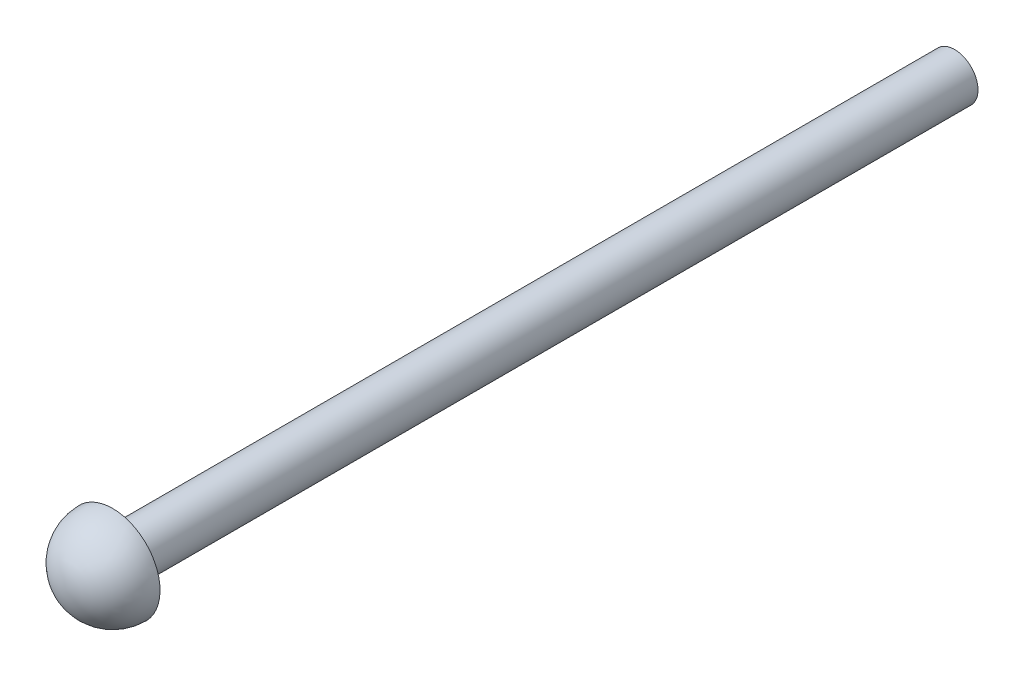
ISO-10303-21;
HEADER;
FILE_DESCRIPTION(('STEP AP214'),'2;1');
FILE_NAME('part.step','',(''),(''),'','','');
FILE_SCHEMA(('AUTOMOTIVE_DESIGN { 1 0 10303 214 1 1 1 1 }'));
ENDSEC;
DATA;
#1=APPLICATION_CONTEXT('core data for automotive mechanical design processes');
#2=APPLICATION_PROTOCOL_DEFINITION('international standard','automotive_design',2000,#1);
#3=PRODUCT_CONTEXT('',#1,'mechanical');
#4=PRODUCT('Part','Part','',(#3));
#5=PRODUCT_RELATED_PRODUCT_CATEGORY('part','',(#4));
#6=PRODUCT_DEFINITION_FORMATION('','',#4);
#7=PRODUCT_DEFINITION_CONTEXT('part definition',#1,'design');
#8=PRODUCT_DEFINITION('design','',#6,#7);
#9=PRODUCT_DEFINITION_SHAPE('','',#8);
#10=(LENGTH_UNIT() NAMED_UNIT(*) SI_UNIT(.MILLI.,.METRE.));
#11=(NAMED_UNIT(*) PLANE_ANGLE_UNIT() SI_UNIT($,.RADIAN.));
#12=(NAMED_UNIT(*) SI_UNIT($,.STERADIAN.) SOLID_ANGLE_UNIT());
#13=UNCERTAINTY_MEASURE_WITH_UNIT(LENGTH_MEASURE(1.E-05),#10,'distance_accuracy_value','');
#14=(GEOMETRIC_REPRESENTATION_CONTEXT(3) GLOBAL_UNCERTAINTY_ASSIGNED_CONTEXT((#13)) GLOBAL_UNIT_ASSIGNED_CONTEXT((#10,
#11,#12)) REPRESENTATION_CONTEXT('',''));
#15=CARTESIAN_POINT('',(0.,0.,0.));
#16=DIRECTION('',(0.,0.,1.));
#17=DIRECTION('',(1.,0.,0.));
#18=AXIS2_PLACEMENT_3D('',#15,#16,#17);
#19=CARTESIAN_POINT('',(0.,0.,114.3));
#20=DIRECTION('',(0.,0.,-1.));
#21=DIRECTION('',(-1.,0.,0.));
#22=AXIS2_PLACEMENT_3D('',#19,#20,#21);
#23=CYLINDRICAL_SURFACE('',#22,3.17500000000003);
#24=CARTESIAN_POINT('',(0.,0.,114.3));
#25=DIRECTION('',(0.,0.,1.));
#26=DIRECTION('',(1.,0.,0.));
#27=AXIS2_PLACEMENT_3D('',#24,#25,#26);
#28=CIRCLE('',#27,3.17500000000003);
#29=CARTESIAN_POINT('',(3.17500000000003,0.,114.3));
#30=VERTEX_POINT('',#29);
#31=EDGE_CURVE('E10',#30,#30,#28,.T.);
#32=ORIENTED_EDGE('',*,*,#31,.F.);
#33=EDGE_LOOP('',(#32));
#34=FACE_BOUND('',#33,.T.);
#35=CARTESIAN_POINT('',(0.,0.,0.));
#36=DIRECTION('',(0.,0.,1.));
#37=DIRECTION('',(1.,0.,0.));
#38=AXIS2_PLACEMENT_3D('',#35,#36,#37);
#39=CIRCLE('',#38,3.17500000000003);
#40=CARTESIAN_POINT('',(3.17500000000003,0.,0.));
#41=VERTEX_POINT('',#40);
#42=EDGE_CURVE('E37',#41,#41,#39,.T.);
#43=ORIENTED_EDGE('',*,*,#42,.T.);
#44=EDGE_LOOP('',(#43));
#45=FACE_BOUND('',#44,.T.);
#46=ADVANCED_FACE('F34',(#34,#45),#23,.T.);
#47=CARTESIAN_POINT('',(0.,0.,0.));
#48=DIRECTION('',(0.,0.,1.));
#49=DIRECTION('',(1.,0.,0.));
#50=AXIS2_PLACEMENT_3D('',#47,#48,#49);
#51=PLANE('',#50);
#52=ORIENTED_EDGE('',*,*,#42,.F.);
#53=EDGE_LOOP('',(#52));
#54=FACE_BOUND('',#53,.T.);
#55=ADVANCED_FACE('F57',(#54),#51,.F.);
#56=CARTESIAN_POINT('',(0.,-1.23663455713198E-13,114.3));
#57=DIRECTION('',(0.,0.,1.));
#58=DIRECTION('',(0.,-1.,0.));
#59=AXIS2_PLACEMENT_3D('',#56,#57,#58);
#60=PLANE('',#59);
#61=ORIENTED_EDGE('',*,*,#31,.T.);
#62=EDGE_LOOP('',(#61));
#63=FACE_BOUND('',#62,.T.);
#64=CARTESIAN_POINT('',(0.,-0.0635000000000002,114.3));
#65=DIRECTION('',(0.,0.,-1.));
#66=DIRECTION('',(0.,1.,0.));
#67=AXIS2_PLACEMENT_3D('',#64,#65,#66);
#68=CIRCLE('',#67,6.41350000000003);
#69=CARTESIAN_POINT('',(0.,6.35000000000003,114.3));
#70=VERTEX_POINT('',#69);
#71=EDGE_CURVE('E44',#70,#70,#68,.T.);
#72=ORIENTED_EDGE('',*,*,#71,.T.);
#73=EDGE_LOOP('',(#72));
#74=FACE_BOUND('',#73,.T.);
#75=ADVANCED_FACE('F49',(#63,#74),#60,.F.);
#76=CARTESIAN_POINT('',(0.,-0.0635000000000002,114.3));
#77=DIRECTION('',(0.,0.,-1.));
#78=DIRECTION('',(0.,1.,0.));
#79=AXIS2_PLACEMENT_3D('',#76,#77,#78);
#80=SPHERICAL_SURFACE('',#79,6.41350000000003);
#81=ORIENTED_EDGE('',*,*,#71,.F.);
#82=EDGE_LOOP('',(#81));
#83=FACE_BOUND('',#82,.T.);
#84=ADVANCED_FACE('F51',(#83),#80,.T.);
#85=CLOSED_SHELL('',(#46,#55,#75,#84));
#86=MANIFOLD_SOLID_BREP('B2',#85);
#87=ADVANCED_BREP_SHAPE_REPRESENTATION('',(#18,#86),#14);
#88=SHAPE_DEFINITION_REPRESENTATION(#9,#87);
ENDSEC;
END-ISO-10303-21;
